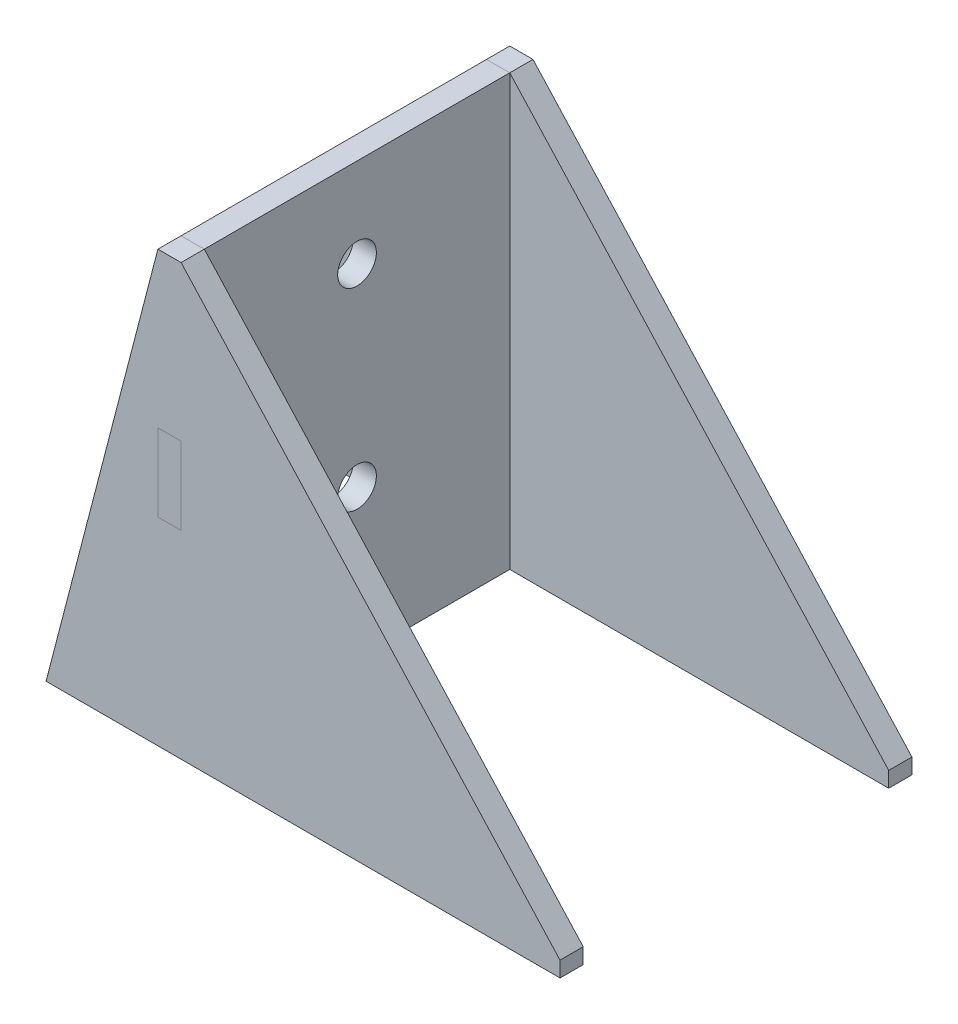
ISO-10303-21;
HEADER;
FILE_DESCRIPTION(('STEP AP214'),'2;1');
FILE_NAME('part.step','',(''),(''),'','','');
FILE_SCHEMA(('AUTOMOTIVE_DESIGN { 1 0 10303 214 1 1 1 1 }'));
ENDSEC;
DATA;
#1=APPLICATION_CONTEXT('core data for automotive mechanical design processes');
#2=APPLICATION_PROTOCOL_DEFINITION('international standard','automotive_design',2000,#1);
#3=PRODUCT_CONTEXT('',#1,'mechanical');
#4=PRODUCT('Part','Part','',(#3));
#5=PRODUCT_RELATED_PRODUCT_CATEGORY('part','',(#4));
#6=PRODUCT_DEFINITION_FORMATION('','',#4);
#7=PRODUCT_DEFINITION_CONTEXT('part definition',#1,'design');
#8=PRODUCT_DEFINITION('design','',#6,#7);
#9=PRODUCT_DEFINITION_SHAPE('','',#8);
#10=(LENGTH_UNIT() NAMED_UNIT(*) SI_UNIT(.MILLI.,.METRE.));
#11=(NAMED_UNIT(*) PLANE_ANGLE_UNIT() SI_UNIT($,.RADIAN.));
#12=(NAMED_UNIT(*) SI_UNIT($,.STERADIAN.) SOLID_ANGLE_UNIT());
#13=UNCERTAINTY_MEASURE_WITH_UNIT(LENGTH_MEASURE(1.E-05),#10,'distance_accuracy_value','');
#14=(GEOMETRIC_REPRESENTATION_CONTEXT(3) GLOBAL_UNCERTAINTY_ASSIGNED_CONTEXT((#13)) GLOBAL_UNIT_ASSIGNED_CONTEXT((#10,
#11,#12)) REPRESENTATION_CONTEXT('',''));
#15=CARTESIAN_POINT('',(0.,0.,0.));
#16=DIRECTION('',(0.,0.,1.));
#17=DIRECTION('',(1.,0.,0.));
#18=AXIS2_PLACEMENT_3D('',#15,#16,#17);
#19=CARTESIAN_POINT('',(84.8675238321578,-376.797488512272,417.047181635811));
#20=DIRECTION('',(0.,0.,1.));
#21=DIRECTION('',(1.,0.,0.));
#22=AXIS2_PLACEMENT_3D('',#19,#20,#21);
#23=PLANE('',#22);
#24=DIRECTION('',(-0.674589209040015,0.738193334463788,0.));
#25=VECTOR('',#24,1.);
#26=CARTESIAN_POINT('',(518.378801320474,3.26976920944033,417.047181635811));
#27=LINE('',#26,#25);
#28=CARTESIAN_POINT('',(518.378801320474,3.26976920944033,417.047181635811));
#29=VERTEX_POINT('',#28);
#30=CARTESIAN_POINT('',(420.378801320474,110.50976920944,417.047181635811));
#31=VERTEX_POINT('',#30);
#32=EDGE_CURVE('E152',#29,#31,#27,.T.);
#33=ORIENTED_EDGE('',*,*,#32,.T.);
#34=DIRECTION('',(-1.,0.,0.));
#35=VECTOR('',#34,1.);
#36=CARTESIAN_POINT('',(420.378801320474,110.50976920944,417.047181635811));
#37=LINE('',#36,#35);
#38=CARTESIAN_POINT('',(414.378801320474,110.50976920944,417.047181635811));
#39=VERTEX_POINT('',#38);
#40=EDGE_CURVE('E155',#31,#39,#37,.T.);
#41=ORIENTED_EDGE('',*,*,#40,.T.);
#42=DIRECTION('',(-0.251589690402251,-0.967833987666945,0.));
#43=VECTOR('',#42,1.);
#44=CARTESIAN_POINT('',(414.378801320474,110.50976920944,417.047181635811));
#45=LINE('',#44,#43);
#46=CARTESIAN_POINT('',(385.461820188399,-0.730230790559672,417.047181635811));
#47=VERTEX_POINT('',#46);
#48=EDGE_CURVE('E158',#39,#47,#45,.T.);
#49=ORIENTED_EDGE('',*,*,#48,.T.);
#50=DIRECTION('',(1.,0.,0.));
#51=VECTOR('',#50,1.);
#52=CARTESIAN_POINT('',(518.378801320474,-0.730230790559616,417.047181635811));
#53=LINE('',#52,#51);
#54=CARTESIAN_POINT('',(518.378801320474,-0.730230790559616,417.047181635811));
#55=VERTEX_POINT('',#54);
#56=EDGE_CURVE('E160',#47,#55,#53,.T.);
#57=ORIENTED_EDGE('',*,*,#56,.T.);
#58=DIRECTION('',(0.,1.,0.));
#59=VECTOR('',#58,1.);
#60=CARTESIAN_POINT('',(518.378801320474,3.26976920944033,417.047181635811));
#61=LINE('',#60,#59);
#62=EDGE_CURVE('E162',#55,#29,#61,.T.);
#63=ORIENTED_EDGE('',*,*,#62,.T.);
#64=EDGE_LOOP('',(#33,#41,#49,#57,#63));
#65=FACE_BOUND('',#64,.T.);
#66=DIRECTION('',(1.,0.,0.));
#67=VECTOR('',#66,1.);
#68=CARTESIAN_POINT('',(414.378801320474,50.5097692094403,417.047181635811));
#69=LINE('',#68,#67);
#70=CARTESIAN_POINT('',(414.378801320474,50.5097692094403,417.047181635811));
#71=VERTEX_POINT('',#70);
#72=CARTESIAN_POINT('',(420.378801320474,50.5097692094403,417.047181635811));
#73=VERTEX_POINT('',#72);
#74=EDGE_CURVE('E124',#71,#73,#69,.T.);
#75=ORIENTED_EDGE('',*,*,#74,.F.);
#76=DIRECTION('',(0.,-1.,0.));
#77=VECTOR('',#76,1.);
#78=CARTESIAN_POINT('',(414.378801320474,70.5097692094403,417.047181635811));
#79=LINE('',#78,#77);
#80=CARTESIAN_POINT('',(414.378801320474,70.5097692094403,417.047181635811));
#81=VERTEX_POINT('',#80);
#82=EDGE_CURVE('E116',#81,#71,#79,.T.);
#83=ORIENTED_EDGE('',*,*,#82,.F.);
#84=DIRECTION('',(-1.,0.,0.));
#85=VECTOR('',#84,1.);
#86=CARTESIAN_POINT('',(420.378801320474,70.5097692094403,417.047181635811));
#87=LINE('',#86,#85);
#88=CARTESIAN_POINT('',(420.378801320474,70.5097692094403,417.047181635811));
#89=VERTEX_POINT('',#88);
#90=EDGE_CURVE('E138',#89,#81,#87,.T.);
#91=ORIENTED_EDGE('',*,*,#90,.F.);
#92=DIRECTION('',(0.,1.,0.));
#93=VECTOR('',#92,1.);
#94=CARTESIAN_POINT('',(420.378801320474,50.5097692094403,417.047181635811));
#95=LINE('',#94,#93);
#96=EDGE_CURVE('E136',#73,#89,#95,.T.);
#97=ORIENTED_EDGE('',*,*,#96,.F.);
#98=EDGE_LOOP('',(#75,#83,#91,#97));
#99=FACE_BOUND('',#98,.T.);
#100=ADVANCED_FACE('F45',(#65,#99),#23,.T.);
#101=CARTESIAN_POINT('',(84.8675238321578,-376.797488512272,411.047181635811));
#102=DIRECTION('',(0.,0.,1.));
#103=DIRECTION('',(1.,0.,0.));
#104=AXIS2_PLACEMENT_3D('',#101,#102,#103);
#105=PLANE('',#104);
#106=DIRECTION('',(-0.674589209040015,0.738193334463788,0.));
#107=VECTOR('',#106,1.);
#108=CARTESIAN_POINT('',(518.378801320474,3.26976920944033,411.047181635811));
#109=LINE('',#108,#107);
#110=CARTESIAN_POINT('',(518.378801320474,3.26976920944033,411.047181635811));
#111=VERTEX_POINT('',#110);
#112=CARTESIAN_POINT('',(420.378801320474,110.50976920944,411.047181635811));
#113=VERTEX_POINT('',#112);
#114=EDGE_CURVE('E132',#111,#113,#109,.T.);
#115=ORIENTED_EDGE('',*,*,#114,.F.);
#116=DIRECTION('',(0.,1.,0.));
#117=VECTOR('',#116,1.);
#118=CARTESIAN_POINT('',(518.378801320474,3.26976920944033,411.047181635811));
#119=LINE('',#118,#117);
#120=CARTESIAN_POINT('',(518.378801320474,-0.730230790559616,411.047181635811));
#121=VERTEX_POINT('',#120);
#122=EDGE_CURVE('E156',#121,#111,#119,.T.);
#123=ORIENTED_EDGE('',*,*,#122,.F.);
#124=DIRECTION('',(1.,0.,0.));
#125=VECTOR('',#124,1.);
#126=CARTESIAN_POINT('',(518.378801320474,-0.730230790559616,411.047181635811));
#127=LINE('',#126,#125);
#128=CARTESIAN_POINT('',(385.461820188399,-0.730230790559672,411.047181635811));
#129=VERTEX_POINT('',#128);
#130=EDGE_CURVE('E171',#129,#121,#127,.T.);
#131=ORIENTED_EDGE('',*,*,#130,.F.);
#132=DIRECTION('',(-0.251589690402251,-0.967833987666945,0.));
#133=VECTOR('',#132,1.);
#134=CARTESIAN_POINT('',(414.378801320474,110.50976920944,411.047181635811));
#135=LINE('',#134,#133);
#136=CARTESIAN_POINT('',(414.378801320474,110.50976920944,411.047181635811));
#137=VERTEX_POINT('',#136);
#138=EDGE_CURVE('E169',#137,#129,#135,.T.);
#139=ORIENTED_EDGE('',*,*,#138,.F.);
#140=DIRECTION('',(-1.,0.,0.));
#141=VECTOR('',#140,1.);
#142=CARTESIAN_POINT('',(420.378801320474,110.50976920944,411.047181635811));
#143=LINE('',#142,#141);
#144=EDGE_CURVE('E167',#113,#137,#143,.T.);
#145=ORIENTED_EDGE('',*,*,#144,.F.);
#146=EDGE_LOOP('',(#115,#123,#131,#139,#145));
#147=FACE_BOUND('',#146,.T.);
#148=DIRECTION('',(0.,-1.,0.));
#149=VECTOR('',#148,1.);
#150=CARTESIAN_POINT('',(414.378801320474,70.5097692094403,411.047181635811));
#151=LINE('',#150,#149);
#152=CARTESIAN_POINT('',(414.378801320474,70.5097692094403,411.047181635811));
#153=VERTEX_POINT('',#152);
#154=CARTESIAN_POINT('',(414.378801320474,50.5097692094403,411.047181635811));
#155=VERTEX_POINT('',#154);
#156=EDGE_CURVE('E68',#153,#155,#151,.T.);
#157=ORIENTED_EDGE('',*,*,#156,.T.);
#158=DIRECTION('',(1.,0.,0.));
#159=VECTOR('',#158,1.);
#160=CARTESIAN_POINT('',(414.378801320474,50.5097692094403,411.047181635811));
#161=LINE('',#160,#159);
#162=CARTESIAN_POINT('',(420.378801320474,50.5097692094403,411.047181635811));
#163=VERTEX_POINT('',#162);
#164=EDGE_CURVE('E131',#155,#163,#161,.T.);
#165=ORIENTED_EDGE('',*,*,#164,.T.);
#166=DIRECTION('',(0.,1.,0.));
#167=VECTOR('',#166,1.);
#168=CARTESIAN_POINT('',(420.378801320474,50.5097692094403,411.047181635811));
#169=LINE('',#168,#167);
#170=CARTESIAN_POINT('',(420.378801320474,70.5097692094403,411.047181635811));
#171=VERTEX_POINT('',#170);
#172=EDGE_CURVE('E144',#163,#171,#169,.T.);
#173=ORIENTED_EDGE('',*,*,#172,.T.);
#174=DIRECTION('',(-1.,0.,0.));
#175=VECTOR('',#174,1.);
#176=CARTESIAN_POINT('',(420.378801320474,70.5097692094403,411.047181635811));
#177=LINE('',#176,#175);
#178=EDGE_CURVE('E125',#171,#153,#177,.T.);
#179=ORIENTED_EDGE('',*,*,#178,.T.);
#180=EDGE_LOOP('',(#157,#165,#173,#179));
#181=FACE_BOUND('',#180,.T.);
#182=ADVANCED_FACE('F192',(#147,#181),#105,.F.);
#183=CARTESIAN_POINT('',(518.378801320474,3.26976920944033,417.047181635811));
#184=DIRECTION('',(-0.738193334463788,-0.674589209040015,0.));
#185=DIRECTION('',(0.674589209040015,-0.738193334463788,0.));
#186=AXIS2_PLACEMENT_3D('',#183,#184,#185);
#187=PLANE('',#186);
#188=ORIENTED_EDGE('',*,*,#114,.T.);
#189=DIRECTION('',(0.,0.,-1.));
#190=VECTOR('',#189,1.);
#191=CARTESIAN_POINT('',(420.378801320474,110.50976920944,417.047181635811));
#192=LINE('',#191,#190);
#193=EDGE_CURVE('E12',#31,#113,#192,.T.);
#194=ORIENTED_EDGE('',*,*,#193,.F.);
#195=ORIENTED_EDGE('',*,*,#32,.F.);
#196=DIRECTION('',(0.,0.,-1.));
#197=VECTOR('',#196,1.);
#198=CARTESIAN_POINT('',(518.378801320474,3.26976920944033,417.047181635811));
#199=LINE('',#198,#197);
#200=EDGE_CURVE('E164',#29,#111,#199,.T.);
#201=ORIENTED_EDGE('',*,*,#200,.T.);
#202=EDGE_LOOP('',(#188,#194,#195,#201));
#203=FACE_BOUND('',#202,.T.);
#204=ADVANCED_FACE('F47',(#203),#187,.F.);
#205=CARTESIAN_POINT('',(420.378801320474,110.50976920944,417.047181635811));
#206=DIRECTION('',(0.,-1.,0.));
#207=DIRECTION('',(0.,0.,-1.));
#208=AXIS2_PLACEMENT_3D('',#205,#206,#207);
#209=PLANE('',#208);
#210=ORIENTED_EDGE('',*,*,#144,.T.);
#211=DIRECTION('',(0.,0.,-1.));
#212=VECTOR('',#211,1.);
#213=CARTESIAN_POINT('',(414.378801320474,110.50976920944,417.047181635811));
#214=LINE('',#213,#212);
#215=EDGE_CURVE('E53',#39,#137,#214,.T.);
#216=ORIENTED_EDGE('',*,*,#215,.F.);
#217=ORIENTED_EDGE('',*,*,#40,.F.);
#218=ORIENTED_EDGE('',*,*,#193,.T.);
#219=EDGE_LOOP('',(#210,#216,#217,#218));
#220=FACE_BOUND('',#219,.T.);
#221=ADVANCED_FACE('F206',(#220),#209,.F.);
#222=CARTESIAN_POINT('',(414.378801320474,110.50976920944,417.047181635811));
#223=DIRECTION('',(0.967833987666945,-0.25158969040225,0.));
#224=DIRECTION('',(0.251589690402251,0.967833987666945,0.));
#225=AXIS2_PLACEMENT_3D('',#222,#223,#224);
#226=PLANE('',#225);
#227=ORIENTED_EDGE('',*,*,#138,.T.);
#228=DIRECTION('',(0.,0.,-1.));
#229=VECTOR('',#228,1.);
#230=CARTESIAN_POINT('',(385.461820188399,-0.730230790559672,417.047181635811));
#231=LINE('',#230,#229);
#232=EDGE_CURVE('E179',#47,#129,#231,.T.);
#233=ORIENTED_EDGE('',*,*,#232,.F.);
#234=ORIENTED_EDGE('',*,*,#48,.F.);
#235=ORIENTED_EDGE('',*,*,#215,.T.);
#236=EDGE_LOOP('',(#227,#233,#234,#235));
#237=FACE_BOUND('',#236,.T.);
#238=ADVANCED_FACE('F186',(#237),#226,.F.);
#239=CARTESIAN_POINT('',(518.378801320474,-0.730230790559616,417.047181635811));
#240=DIRECTION('',(0.,1.,0.));
#241=DIRECTION('',(-1.,0.,0.));
#242=AXIS2_PLACEMENT_3D('',#239,#240,#241);
#243=PLANE('',#242);
#244=ORIENTED_EDGE('',*,*,#130,.T.);
#245=DIRECTION('',(0.,0.,-1.));
#246=VECTOR('',#245,1.);
#247=CARTESIAN_POINT('',(518.378801320474,-0.730230790559616,417.047181635811));
#248=LINE('',#247,#246);
#249=EDGE_CURVE('E176',#55,#121,#248,.T.);
#250=ORIENTED_EDGE('',*,*,#249,.F.);
#251=ORIENTED_EDGE('',*,*,#56,.F.);
#252=ORIENTED_EDGE('',*,*,#232,.T.);
#253=EDGE_LOOP('',(#244,#250,#251,#252));
#254=FACE_BOUND('',#253,.T.);
#255=ADVANCED_FACE('F197',(#254),#243,.F.);
#256=CARTESIAN_POINT('',(518.378801320474,3.26976920944033,417.047181635811));
#257=DIRECTION('',(-1.,0.,0.));
#258=DIRECTION('',(0.,0.,1.));
#259=AXIS2_PLACEMENT_3D('',#256,#257,#258);
#260=PLANE('',#259);
#261=ORIENTED_EDGE('',*,*,#122,.T.);
#262=ORIENTED_EDGE('',*,*,#200,.F.);
#263=ORIENTED_EDGE('',*,*,#62,.F.);
#264=ORIENTED_EDGE('',*,*,#249,.T.);
#265=EDGE_LOOP('',(#261,#262,#263,#264));
#266=FACE_BOUND('',#265,.T.);
#267=ADVANCED_FACE('F201',(#266),#260,.F.);
#268=CARTESIAN_POINT('',(414.378801320474,70.5097692094403,417.047181635811));
#269=DIRECTION('',(1.,0.,0.));
#270=DIRECTION('',(0.,0.,-1.));
#271=AXIS2_PLACEMENT_3D('',#268,#269,#270);
#272=PLANE('',#271);
#273=ORIENTED_EDGE('',*,*,#156,.F.);
#274=DIRECTION('',(0.,0.,-1.));
#275=VECTOR('',#274,1.);
#276=CARTESIAN_POINT('',(414.378801320474,70.5097692094403,417.047181635811));
#277=LINE('',#276,#275);
#278=EDGE_CURVE('E120',#81,#153,#277,.T.);
#279=ORIENTED_EDGE('',*,*,#278,.F.);
#280=ORIENTED_EDGE('',*,*,#82,.T.);
#281=DIRECTION('',(0.,0.,-1.));
#282=VECTOR('',#281,1.);
#283=CARTESIAN_POINT('',(414.378801320474,50.5097692094403,417.047181635811));
#284=LINE('',#283,#282);
#285=EDGE_CURVE('E119',#71,#155,#284,.T.);
#286=ORIENTED_EDGE('',*,*,#285,.T.);
#287=EDGE_LOOP('',(#273,#279,#280,#286));
#288=FACE_BOUND('',#287,.T.);
#289=ADVANCED_FACE('F118',(#288),#272,.T.);
#290=CARTESIAN_POINT('',(414.378801320474,50.5097692094403,417.047181635811));
#291=DIRECTION('',(0.,1.,0.));
#292=DIRECTION('',(0.,0.,1.));
#293=AXIS2_PLACEMENT_3D('',#290,#291,#292);
#294=PLANE('',#293);
#295=ORIENTED_EDGE('',*,*,#164,.F.);
#296=ORIENTED_EDGE('',*,*,#285,.F.);
#297=ORIENTED_EDGE('',*,*,#74,.T.);
#298=DIRECTION('',(0.,0.,-1.));
#299=VECTOR('',#298,1.);
#300=CARTESIAN_POINT('',(420.378801320474,50.5097692094403,417.047181635811));
#301=LINE('',#300,#299);
#302=EDGE_CURVE('E133',#73,#163,#301,.T.);
#303=ORIENTED_EDGE('',*,*,#302,.T.);
#304=EDGE_LOOP('',(#295,#296,#297,#303));
#305=FACE_BOUND('',#304,.T.);
#306=ADVANCED_FACE('F128',(#305),#294,.T.);
#307=CARTESIAN_POINT('',(420.378801320474,50.5097692094403,417.047181635811));
#308=DIRECTION('',(-1.,0.,0.));
#309=DIRECTION('',(0.,0.,1.));
#310=AXIS2_PLACEMENT_3D('',#307,#308,#309);
#311=PLANE('',#310);
#312=ORIENTED_EDGE('',*,*,#172,.F.);
#313=ORIENTED_EDGE('',*,*,#302,.F.);
#314=ORIENTED_EDGE('',*,*,#96,.T.);
#315=DIRECTION('',(0.,0.,-1.));
#316=VECTOR('',#315,1.);
#317=CARTESIAN_POINT('',(420.378801320474,70.5097692094403,417.047181635811));
#318=LINE('',#317,#316);
#319=EDGE_CURVE('E60',#89,#171,#318,.T.);
#320=ORIENTED_EDGE('',*,*,#319,.T.);
#321=EDGE_LOOP('',(#312,#313,#314,#320));
#322=FACE_BOUND('',#321,.T.);
#323=ADVANCED_FACE('F249',(#322),#311,.T.);
#324=CARTESIAN_POINT('',(420.378801320474,70.5097692094403,417.047181635811));
#325=DIRECTION('',(0.,-1.,0.));
#326=DIRECTION('',(0.,0.,-1.));
#327=AXIS2_PLACEMENT_3D('',#324,#325,#326);
#328=PLANE('',#327);
#329=ORIENTED_EDGE('',*,*,#178,.F.);
#330=ORIENTED_EDGE('',*,*,#319,.F.);
#331=ORIENTED_EDGE('',*,*,#90,.T.);
#332=ORIENTED_EDGE('',*,*,#278,.T.);
#333=EDGE_LOOP('',(#329,#330,#331,#332));
#334=FACE_BOUND('',#333,.T.);
#335=ADVANCED_FACE('F255',(#334),#328,.T.);
#336=CLOSED_SHELL('',(#100,#182,#204,#221,#238,#255,#267,#289,#306,#323,#335));
#337=MANIFOLD_SOLID_BREP('B2',#336);
#338=CARTESIAN_POINT('',(420.378801320474,0.,0.));
#339=DIRECTION('',(-1.,0.,0.));
#340=DIRECTION('',(0.,0.,1.));
#341=AXIS2_PLACEMENT_3D('',#338,#339,#340);
#342=PLANE('',#341);
#343=DIRECTION('',(0.,1.,0.));
#344=VECTOR('',#343,1.);
#345=CARTESIAN_POINT('',(420.378801320474,110.50976920944,332.047181635811));
#346=LINE('',#345,#344);
#347=CARTESIAN_POINT('',(420.378801320474,80.5097692094402,332.047181635811));
#348=VERTEX_POINT('',#347);
#349=CARTESIAN_POINT('',(420.378801320474,110.50976920944,332.047181635811));
#350=VERTEX_POINT('',#349);
#351=EDGE_CURVE('E453',#348,#350,#346,.T.);
#352=ORIENTED_EDGE('',*,*,#351,.T.);
#353=DIRECTION('',(0.,0.,1.));
#354=VECTOR('',#353,1.);
#355=CARTESIAN_POINT('',(420.378801320474,110.50976920944,332.047181635811));
#356=LINE('',#355,#354);
#357=CARTESIAN_POINT('',(420.378801320474,110.50976920944,411.047181635811));
#358=VERTEX_POINT('',#357);
#359=EDGE_CURVE('E381',#350,#358,#356,.T.);
#360=ORIENTED_EDGE('',*,*,#359,.T.);
#361=DIRECTION('',(0.,-1.,0.));
#362=VECTOR('',#361,1.);
#363=CARTESIAN_POINT('',(420.378801320474,110.50976920944,411.047181635811));
#364=LINE('',#363,#362);
#365=CARTESIAN_POINT('',(420.378801320474,70.5097692094403,411.047181635811));
#366=VERTEX_POINT('',#365);
#367=EDGE_CURVE('E480',#358,#366,#364,.T.);
#368=ORIENTED_EDGE('',*,*,#367,.T.);
#369=DIRECTION('',(0.,0.,1.));
#370=VECTOR('',#369,1.);
#371=CARTESIAN_POINT('',(420.378801320474,70.5097692094403,417.047181635811));
#372=LINE('',#371,#370);
#373=CARTESIAN_POINT('',(420.378801320474,70.5097692094403,417.047181635811));
#374=VERTEX_POINT('',#373);
#375=EDGE_CURVE('E499',#366,#374,#372,.T.);
#376=ORIENTED_EDGE('',*,*,#375,.T.);
#377=DIRECTION('',(0.,-1.,0.));
#378=VECTOR('',#377,1.);
#379=CARTESIAN_POINT('',(420.378801320474,50.5099140255015,417.047181635811));
#380=LINE('',#379,#378);
#381=CARTESIAN_POINT('',(420.378801320474,50.5099140255015,417.047181635811));
#382=VERTEX_POINT('',#381);
#383=EDGE_CURVE('E496',#374,#382,#380,.T.);
#384=ORIENTED_EDGE('',*,*,#383,.T.);
#385=DIRECTION('',(0.,-4.82720203536056E-05,-0.999999998834906));
#386=VECTOR('',#385,1.);
#387=CARTESIAN_POINT('',(420.378801320474,50.5099140255015,417.047181635811));
#388=LINE('',#387,#386);
#389=CARTESIAN_POINT('',(420.378801320474,50.5096243933791,411.047181635811));
#390=VERTEX_POINT('',#389);
#391=EDGE_CURVE('E498',#382,#390,#388,.T.);
#392=ORIENTED_EDGE('',*,*,#391,.T.);
#393=DIRECTION('',(0.,-1.,0.));
#394=VECTOR('',#393,1.);
#395=CARTESIAN_POINT('',(420.378801320474,50.5096243933791,411.047181635811));
#396=LINE('',#395,#394);
#397=CARTESIAN_POINT('',(420.378801320474,-0.730230790559658,411.047181635811));
#398=VERTEX_POINT('',#397);
#399=EDGE_CURVE('E501',#390,#398,#396,.T.);
#400=ORIENTED_EDGE('',*,*,#399,.T.);
#401=DIRECTION('',(0.,0.,-1.));
#402=VECTOR('',#401,1.);
#403=CARTESIAN_POINT('',(420.378801320474,-0.730230790559658,411.047181635811));
#404=LINE('',#403,#402);
#405=CARTESIAN_POINT('',(420.378801320474,-0.730230790559658,332.047181635811));
#406=VERTEX_POINT('',#405);
#407=EDGE_CURVE('E507',#398,#406,#404,.T.);
#408=ORIENTED_EDGE('',*,*,#407,.T.);
#409=DIRECTION('',(0.,1.,0.));
#410=VECTOR('',#409,1.);
#411=CARTESIAN_POINT('',(420.378801320474,55.5097692094402,332.047181635811));
#412=LINE('',#411,#410);
#413=CARTESIAN_POINT('',(420.378801320474,55.5097692094402,332.047181635811));
#414=VERTEX_POINT('',#413);
#415=EDGE_CURVE('E412',#406,#414,#412,.T.);
#416=ORIENTED_EDGE('',*,*,#415,.T.);
#417=DIRECTION('',(0.,0.,-1.));
#418=VECTOR('',#417,1.);
#419=CARTESIAN_POINT('',(420.378801320474,55.5097692094402,326.047181635811));
#420=LINE('',#419,#418);
#421=CARTESIAN_POINT('',(420.378801320474,55.5097692094402,326.047181635811));
#422=VERTEX_POINT('',#421);
#423=EDGE_CURVE('E406',#414,#422,#420,.T.);
#424=ORIENTED_EDGE('',*,*,#423,.T.);
#425=DIRECTION('',(0.,1.,0.));
#426=VECTOR('',#425,1.);
#427=CARTESIAN_POINT('',(420.378801320474,80.5097692094402,326.047181635811));
#428=LINE('',#427,#426);
#429=CARTESIAN_POINT('',(420.378801320474,80.5097692094402,326.047181635811));
#430=VERTEX_POINT('',#429);
#431=EDGE_CURVE('E410',#422,#430,#428,.T.);
#432=ORIENTED_EDGE('',*,*,#431,.T.);
#433=DIRECTION('',(0.,0.,1.));
#434=VECTOR('',#433,1.);
#435=CARTESIAN_POINT('',(420.378801320474,80.5097692094402,326.047181635811));
#436=LINE('',#435,#434);
#437=EDGE_CURVE('E326',#430,#348,#436,.T.);
#438=ORIENTED_EDGE('',*,*,#437,.T.);
#439=EDGE_LOOP('',(#352,#360,#368,#376,#384,#392,#400,#408,#416,#424,#432,#438));
#440=FACE_BOUND('',#439,.T.);
#441=CARTESIAN_POINT('',(420.378801320474,87.5097692094403,371.547181635811));
#442=DIRECTION('',(1.,0.,0.));
#443=DIRECTION('',(0.,0.,-1.));
#444=AXIS2_PLACEMENT_3D('',#441,#442,#443);
#445=CIRCLE('',#444,4.99999999999999);
#446=CARTESIAN_POINT('',(420.378801320474,87.5097692094403,366.547181635811));
#447=VERTEX_POINT('',#446);
#448=EDGE_CURVE('E434',#447,#447,#445,.T.);
#449=ORIENTED_EDGE('',*,*,#448,.F.);
#450=EDGE_LOOP('',(#449));
#451=FACE_BOUND('',#450,.T.);
#452=CARTESIAN_POINT('',(420.378801320474,37.5097692094403,371.547181635811));
#453=DIRECTION('',(1.,0.,0.));
#454=DIRECTION('',(0.,0.,-1.));
#455=AXIS2_PLACEMENT_3D('',#452,#453,#454);
#456=CIRCLE('',#455,4.99999999999999);
#457=CARTESIAN_POINT('',(420.378801320474,37.5097692094403,366.547181635811));
#458=VERTEX_POINT('',#457);
#459=EDGE_CURVE('E548',#458,#458,#456,.T.);
#460=ORIENTED_EDGE('',*,*,#459,.F.);
#461=EDGE_LOOP('',(#460));
#462=FACE_BOUND('',#461,.T.);
#463=ADVANCED_FACE('F309',(#440,#451,#462),#342,.F.);
#464=CARTESIAN_POINT('',(414.378801320474,0.,0.));
#465=DIRECTION('',(-1.,0.,0.));
#466=DIRECTION('',(0.,0.,1.));
#467=AXIS2_PLACEMENT_3D('',#464,#465,#466);
#468=PLANE('',#467);
#469=CARTESIAN_POINT('',(414.378801320474,87.5097692094403,371.547181635811));
#470=DIRECTION('',(1.,0.,0.));
#471=DIRECTION('',(0.,0.,-1.));
#472=AXIS2_PLACEMENT_3D('',#469,#470,#471);
#473=CIRCLE('',#472,4.99999999999999);
#474=CARTESIAN_POINT('',(414.378801320474,87.5097692094403,366.547181635811));
#475=VERTEX_POINT('',#474);
#476=EDGE_CURVE('E553',#475,#475,#473,.T.);
#477=ORIENTED_EDGE('',*,*,#476,.T.);
#478=EDGE_LOOP('',(#477));
#479=FACE_BOUND('',#478,.T.);
#480=DIRECTION('',(0.,1.,0.));
#481=VECTOR('',#480,1.);
#482=CARTESIAN_POINT('',(414.378801320474,110.50976920944,332.047181635811));
#483=LINE('',#482,#481);
#484=CARTESIAN_POINT('',(414.378801320474,80.5097692094402,332.047181635811));
#485=VERTEX_POINT('',#484);
#486=CARTESIAN_POINT('',(414.378801320474,110.50976920944,332.047181635811));
#487=VERTEX_POINT('',#486);
#488=EDGE_CURVE('E430',#485,#487,#483,.T.);
#489=ORIENTED_EDGE('',*,*,#488,.F.);
#490=DIRECTION('',(0.,0.,1.));
#491=VECTOR('',#490,1.);
#492=CARTESIAN_POINT('',(414.378801320474,80.5097692094402,326.047181635811));
#493=LINE('',#492,#491);
#494=CARTESIAN_POINT('',(414.378801320474,80.5097692094402,326.047181635811));
#495=VERTEX_POINT('',#494);
#496=EDGE_CURVE('E373',#495,#485,#493,.T.);
#497=ORIENTED_EDGE('',*,*,#496,.F.);
#498=DIRECTION('',(0.,1.,0.));
#499=VECTOR('',#498,1.);
#500=CARTESIAN_POINT('',(414.378801320474,80.5097692094402,326.047181635811));
#501=LINE('',#500,#499);
#502=CARTESIAN_POINT('',(414.378801320474,55.5097692094402,326.047181635811));
#503=VERTEX_POINT('',#502);
#504=EDGE_CURVE('E367',#503,#495,#501,.T.);
#505=ORIENTED_EDGE('',*,*,#504,.F.);
#506=DIRECTION('',(0.,0.,-1.));
#507=VECTOR('',#506,1.);
#508=CARTESIAN_POINT('',(414.378801320474,55.5097692094402,326.047181635811));
#509=LINE('',#508,#507);
#510=CARTESIAN_POINT('',(414.378801320474,55.5097692094402,332.047181635811));
#511=VERTEX_POINT('',#510);
#512=EDGE_CURVE('E420',#511,#503,#509,.T.);
#513=ORIENTED_EDGE('',*,*,#512,.F.);
#514=DIRECTION('',(0.,1.,0.));
#515=VECTOR('',#514,1.);
#516=CARTESIAN_POINT('',(414.378801320474,55.5097692094402,332.047181635811));
#517=LINE('',#516,#515);
#518=CARTESIAN_POINT('',(414.378801320474,-0.730230790559658,332.047181635811));
#519=VERTEX_POINT('',#518);
#520=EDGE_CURVE('E448',#519,#511,#517,.T.);
#521=ORIENTED_EDGE('',*,*,#520,.F.);
#522=DIRECTION('',(0.,0.,-1.));
#523=VECTOR('',#522,1.);
#524=CARTESIAN_POINT('',(414.378801320474,-0.730230790559658,411.047181635811));
#525=LINE('',#524,#523);
#526=CARTESIAN_POINT('',(414.378801320474,-0.730230790559658,411.047181635811));
#527=VERTEX_POINT('',#526);
#528=EDGE_CURVE('E446',#527,#519,#525,.T.);
#529=ORIENTED_EDGE('',*,*,#528,.F.);
#530=DIRECTION('',(0.,-1.,0.));
#531=VECTOR('',#530,1.);
#532=CARTESIAN_POINT('',(414.378801320474,50.5096243933791,411.047181635811));
#533=LINE('',#532,#531);
#534=CARTESIAN_POINT('',(414.378801320474,50.5096243933791,411.047181635811));
#535=VERTEX_POINT('',#534);
#536=EDGE_CURVE('E444',#535,#527,#533,.T.);
#537=ORIENTED_EDGE('',*,*,#536,.F.);
#538=DIRECTION('',(0.,-4.82720203536056E-05,-0.999999998834906));
#539=VECTOR('',#538,1.);
#540=CARTESIAN_POINT('',(414.378801320474,50.5099140255015,417.047181635811));
#541=LINE('',#540,#539);
#542=CARTESIAN_POINT('',(414.378801320474,50.5099140255015,417.047181635811));
#543=VERTEX_POINT('',#542);
#544=EDGE_CURVE('E442',#543,#535,#541,.T.);
#545=ORIENTED_EDGE('',*,*,#544,.F.);
#546=DIRECTION('',(0.,-1.,0.));
#547=VECTOR('',#546,1.);
#548=CARTESIAN_POINT('',(414.378801320474,50.5099140255015,417.047181635811));
#549=LINE('',#548,#547);
#550=CARTESIAN_POINT('',(414.378801320474,70.5097692094403,417.047181635811));
#551=VERTEX_POINT('',#550);
#552=EDGE_CURVE('E440',#551,#543,#549,.T.);
#553=ORIENTED_EDGE('',*,*,#552,.F.);
#554=DIRECTION('',(0.,0.,1.));
#555=VECTOR('',#554,1.);
#556=CARTESIAN_POINT('',(414.378801320474,70.5097692094403,417.047181635811));
#557=LINE('',#556,#555);
#558=CARTESIAN_POINT('',(414.378801320474,70.5097692094403,411.047181635811));
#559=VERTEX_POINT('',#558);
#560=EDGE_CURVE('E438',#559,#551,#557,.T.);
#561=ORIENTED_EDGE('',*,*,#560,.F.);
#562=DIRECTION('',(0.,-1.,0.));
#563=VECTOR('',#562,1.);
#564=CARTESIAN_POINT('',(414.378801320474,110.50976920944,411.047181635811));
#565=LINE('',#564,#563);
#566=CARTESIAN_POINT('',(414.378801320474,110.50976920944,411.047181635811));
#567=VERTEX_POINT('',#566);
#568=EDGE_CURVE('E436',#567,#559,#565,.T.);
#569=ORIENTED_EDGE('',*,*,#568,.F.);
#570=DIRECTION('',(0.,0.,1.));
#571=VECTOR('',#570,1.);
#572=CARTESIAN_POINT('',(414.378801320474,110.50976920944,332.047181635811));
#573=LINE('',#572,#571);
#574=EDGE_CURVE('E433',#487,#567,#573,.T.);
#575=ORIENTED_EDGE('',*,*,#574,.F.);
#576=EDGE_LOOP('',(#489,#497,#505,#513,#521,#529,#537,#545,#553,#561,#569,#575));
#577=FACE_BOUND('',#576,.T.);
#578=CARTESIAN_POINT('',(414.378801320474,37.5097692094403,371.547181635811));
#579=DIRECTION('',(1.,0.,0.));
#580=DIRECTION('',(0.,0.,-1.));
#581=AXIS2_PLACEMENT_3D('',#578,#579,#580);
#582=CIRCLE('',#581,4.99999999999999);
#583=CARTESIAN_POINT('',(414.378801320474,37.5097692094403,366.547181635811));
#584=VERTEX_POINT('',#583);
#585=EDGE_CURVE('E551',#584,#584,#582,.T.);
#586=ORIENTED_EDGE('',*,*,#585,.T.);
#587=EDGE_LOOP('',(#586));
#588=FACE_BOUND('',#587,.T.);
#589=ADVANCED_FACE('F484',(#479,#577,#588),#468,.T.);
#590=CARTESIAN_POINT('',(420.378801320474,110.50976920944,332.047181635811));
#591=DIRECTION('',(0.,0.,1.));
#592=DIRECTION('',(1.,0.,0.));
#593=AXIS2_PLACEMENT_3D('',#590,#591,#592);
#594=PLANE('',#593);
#595=ORIENTED_EDGE('',*,*,#488,.T.);
#596=DIRECTION('',(-1.,0.,0.));
#597=VECTOR('',#596,1.);
#598=CARTESIAN_POINT('',(420.378801320474,110.50976920944,332.047181635811));
#599=LINE('',#598,#597);
#600=EDGE_CURVE('E43',#350,#487,#599,.T.);
#601=ORIENTED_EDGE('',*,*,#600,.F.);
#602=ORIENTED_EDGE('',*,*,#351,.F.);
#603=DIRECTION('',(-1.,0.,0.));
#604=VECTOR('',#603,1.);
#605=CARTESIAN_POINT('',(420.378801320474,80.5097692094402,332.047181635811));
#606=LINE('',#605,#604);
#607=EDGE_CURVE('E426',#348,#485,#606,.T.);
#608=ORIENTED_EDGE('',*,*,#607,.T.);
#609=EDGE_LOOP('',(#595,#601,#602,#608));
#610=FACE_BOUND('',#609,.T.);
#611=ADVANCED_FACE('F311',(#610),#594,.F.);
#612=CARTESIAN_POINT('',(420.378801320474,110.50976920944,332.047181635811));
#613=DIRECTION('',(0.,-1.,0.));
#614=DIRECTION('',(0.,0.,-1.));
#615=AXIS2_PLACEMENT_3D('',#612,#613,#614);
#616=PLANE('',#615);
#617=ORIENTED_EDGE('',*,*,#574,.T.);
#618=DIRECTION('',(-1.,0.,0.));
#619=VECTOR('',#618,1.);
#620=CARTESIAN_POINT('',(420.378801320474,110.50976920944,411.047181635811));
#621=LINE('',#620,#619);
#622=EDGE_CURVE('E318',#358,#567,#621,.T.);
#623=ORIENTED_EDGE('',*,*,#622,.F.);
#624=ORIENTED_EDGE('',*,*,#359,.F.);
#625=ORIENTED_EDGE('',*,*,#600,.T.);
#626=EDGE_LOOP('',(#617,#623,#624,#625));
#627=FACE_BOUND('',#626,.T.);
#628=ADVANCED_FACE('F648',(#627),#616,.F.);
#629=CARTESIAN_POINT('',(420.378801320474,110.50976920944,411.047181635811));
#630=DIRECTION('',(0.,0.,-1.));
#631=DIRECTION('',(-1.,0.,0.));
#632=AXIS2_PLACEMENT_3D('',#629,#630,#631);
#633=PLANE('',#632);
#634=ORIENTED_EDGE('',*,*,#568,.T.);
#635=DIRECTION('',(-1.,0.,0.));
#636=VECTOR('',#635,1.);
#637=CARTESIAN_POINT('',(420.378801320474,70.5097692094403,411.047181635811));
#638=LINE('',#637,#636);
#639=EDGE_CURVE('E472',#366,#559,#638,.T.);
#640=ORIENTED_EDGE('',*,*,#639,.F.);
#641=ORIENTED_EDGE('',*,*,#367,.F.);
#642=ORIENTED_EDGE('',*,*,#622,.T.);
#643=EDGE_LOOP('',(#634,#640,#641,#642));
#644=FACE_BOUND('',#643,.T.);
#645=ADVANCED_FACE('F478',(#644),#633,.F.);
#646=CARTESIAN_POINT('',(420.378801320474,70.5097692094403,417.047181635811));
#647=DIRECTION('',(0.,-1.,0.));
#648=DIRECTION('',(0.,0.,-1.));
#649=AXIS2_PLACEMENT_3D('',#646,#647,#648);
#650=PLANE('',#649);
#651=ORIENTED_EDGE('',*,*,#560,.T.);
#652=DIRECTION('',(-1.,0.,0.));
#653=VECTOR('',#652,1.);
#654=CARTESIAN_POINT('',(420.378801320474,70.5097692094403,417.047181635811));
#655=LINE('',#654,#653);
#656=EDGE_CURVE('E469',#374,#551,#655,.T.);
#657=ORIENTED_EDGE('',*,*,#656,.F.);
#658=ORIENTED_EDGE('',*,*,#375,.F.);
#659=ORIENTED_EDGE('',*,*,#639,.T.);
#660=EDGE_LOOP('',(#651,#657,#658,#659));
#661=FACE_BOUND('',#660,.T.);
#662=ADVANCED_FACE('F490',(#661),#650,.F.);
#663=CARTESIAN_POINT('',(420.378801320474,50.5099140255015,417.047181635811));
#664=DIRECTION('',(0.,0.,-1.));
#665=DIRECTION('',(-1.,0.,0.));
#666=AXIS2_PLACEMENT_3D('',#663,#664,#665);
#667=PLANE('',#666);
#668=ORIENTED_EDGE('',*,*,#552,.T.);
#669=DIRECTION('',(-1.,0.,0.));
#670=VECTOR('',#669,1.);
#671=CARTESIAN_POINT('',(420.378801320474,50.5099140255015,417.047181635811));
#672=LINE('',#671,#670);
#673=EDGE_CURVE('E466',#382,#543,#672,.T.);
#674=ORIENTED_EDGE('',*,*,#673,.F.);
#675=ORIENTED_EDGE('',*,*,#383,.F.);
#676=ORIENTED_EDGE('',*,*,#656,.T.);
#677=EDGE_LOOP('',(#668,#674,#675,#676));
#678=FACE_BOUND('',#677,.T.);
#679=ADVANCED_FACE('F494',(#678),#667,.F.);
#680=CARTESIAN_POINT('',(420.378801320474,50.5099140255015,417.047181635811));
#681=DIRECTION('',(0.,0.999999998834906,-4.82720203536056E-05));
#682=DIRECTION('',(0.,4.82720203536056E-05,0.999999998834906));
#683=AXIS2_PLACEMENT_3D('',#680,#681,#682);
#684=PLANE('',#683);
#685=ORIENTED_EDGE('',*,*,#544,.T.);
#686=DIRECTION('',(-1.,0.,0.));
#687=VECTOR('',#686,1.);
#688=CARTESIAN_POINT('',(420.378801320474,50.5096243933791,411.047181635811));
#689=LINE('',#688,#687);
#690=EDGE_CURVE('E463',#390,#535,#689,.T.);
#691=ORIENTED_EDGE('',*,*,#690,.F.);
#692=ORIENTED_EDGE('',*,*,#391,.F.);
#693=ORIENTED_EDGE('',*,*,#673,.T.);
#694=EDGE_LOOP('',(#685,#691,#692,#693));
#695=FACE_BOUND('',#694,.T.);
#696=ADVANCED_FACE('F613',(#695),#684,.F.);
#697=CARTESIAN_POINT('',(420.378801320474,50.5096243933791,411.047181635811));
#698=DIRECTION('',(0.,0.,-1.));
#699=DIRECTION('',(-1.,0.,0.));
#700=AXIS2_PLACEMENT_3D('',#697,#698,#699);
#701=PLANE('',#700);
#702=ORIENTED_EDGE('',*,*,#536,.T.);
#703=DIRECTION('',(-1.,0.,0.));
#704=VECTOR('',#703,1.);
#705=CARTESIAN_POINT('',(420.378801320474,-0.730230790559658,411.047181635811));
#706=LINE('',#705,#704);
#707=EDGE_CURVE('E460',#398,#527,#706,.T.);
#708=ORIENTED_EDGE('',*,*,#707,.F.);
#709=ORIENTED_EDGE('',*,*,#399,.F.);
#710=ORIENTED_EDGE('',*,*,#690,.T.);
#711=EDGE_LOOP('',(#702,#708,#709,#710));
#712=FACE_BOUND('',#711,.T.);
#713=ADVANCED_FACE('F604',(#712),#701,.F.);
#714=CARTESIAN_POINT('',(420.378801320474,-0.730230790559658,411.047181635811));
#715=DIRECTION('',(0.,1.,0.));
#716=DIRECTION('',(0.,0.,1.));
#717=AXIS2_PLACEMENT_3D('',#714,#715,#716);
#718=PLANE('',#717);
#719=ORIENTED_EDGE('',*,*,#528,.T.);
#720=DIRECTION('',(-1.,0.,0.));
#721=VECTOR('',#720,1.);
#722=CARTESIAN_POINT('',(420.378801320474,-0.730230790559658,332.047181635811));
#723=LINE('',#722,#721);
#724=EDGE_CURVE('E457',#406,#519,#723,.T.);
#725=ORIENTED_EDGE('',*,*,#724,.F.);
#726=ORIENTED_EDGE('',*,*,#407,.F.);
#727=ORIENTED_EDGE('',*,*,#707,.T.);
#728=EDGE_LOOP('',(#719,#725,#726,#727));
#729=FACE_BOUND('',#728,.T.);
#730=ADVANCED_FACE('F513',(#729),#718,.F.);
#731=CARTESIAN_POINT('',(420.378801320474,55.5097692094402,332.047181635811));
#732=DIRECTION('',(0.,0.,1.));
#733=DIRECTION('',(1.,0.,0.));
#734=AXIS2_PLACEMENT_3D('',#731,#732,#733);
#735=PLANE('',#734);
#736=ORIENTED_EDGE('',*,*,#520,.T.);
#737=DIRECTION('',(-1.,0.,0.));
#738=VECTOR('',#737,1.);
#739=CARTESIAN_POINT('',(420.378801320474,55.5097692094402,332.047181635811));
#740=LINE('',#739,#738);
#741=EDGE_CURVE('E421',#414,#511,#740,.T.);
#742=ORIENTED_EDGE('',*,*,#741,.F.);
#743=ORIENTED_EDGE('',*,*,#415,.F.);
#744=ORIENTED_EDGE('',*,*,#724,.T.);
#745=EDGE_LOOP('',(#736,#742,#743,#744));
#746=FACE_BOUND('',#745,.T.);
#747=ADVANCED_FACE('F517',(#746),#735,.F.);
#748=CARTESIAN_POINT('',(420.378801320474,55.5097692094402,326.047181635811));
#749=DIRECTION('',(0.,1.,0.));
#750=DIRECTION('',(0.,0.,1.));
#751=AXIS2_PLACEMENT_3D('',#748,#749,#750);
#752=PLANE('',#751);
#753=ORIENTED_EDGE('',*,*,#512,.T.);
#754=DIRECTION('',(-1.,0.,0.));
#755=VECTOR('',#754,1.);
#756=CARTESIAN_POINT('',(420.378801320474,55.5097692094402,326.047181635811));
#757=LINE('',#756,#755);
#758=EDGE_CURVE('E417',#422,#503,#757,.T.);
#759=ORIENTED_EDGE('',*,*,#758,.F.);
#760=ORIENTED_EDGE('',*,*,#423,.F.);
#761=ORIENTED_EDGE('',*,*,#741,.T.);
#762=EDGE_LOOP('',(#753,#759,#760,#761));
#763=FACE_BOUND('',#762,.T.);
#764=ADVANCED_FACE('F418',(#763),#752,.F.);
#765=CARTESIAN_POINT('',(420.378801320474,80.5097692094402,326.047181635811));
#766=DIRECTION('',(0.,0.,1.));
#767=DIRECTION('',(1.,0.,0.));
#768=AXIS2_PLACEMENT_3D('',#765,#766,#767);
#769=PLANE('',#768);
#770=ORIENTED_EDGE('',*,*,#504,.T.);
#771=DIRECTION('',(-1.,0.,0.));
#772=VECTOR('',#771,1.);
#773=CARTESIAN_POINT('',(420.378801320474,80.5097692094402,326.047181635811));
#774=LINE('',#773,#772);
#775=EDGE_CURVE('E422',#430,#495,#774,.T.);
#776=ORIENTED_EDGE('',*,*,#775,.F.);
#777=ORIENTED_EDGE('',*,*,#431,.F.);
#778=ORIENTED_EDGE('',*,*,#758,.T.);
#779=EDGE_LOOP('',(#770,#776,#777,#778));
#780=FACE_BOUND('',#779,.T.);
#781=ADVANCED_FACE('F424',(#780),#769,.F.);
#782=CARTESIAN_POINT('',(420.378801320474,80.5097692094402,326.047181635811));
#783=DIRECTION('',(0.,-1.,0.));
#784=DIRECTION('',(0.,0.,-1.));
#785=AXIS2_PLACEMENT_3D('',#782,#783,#784);
#786=PLANE('',#785);
#787=ORIENTED_EDGE('',*,*,#496,.T.);
#788=ORIENTED_EDGE('',*,*,#607,.F.);
#789=ORIENTED_EDGE('',*,*,#437,.F.);
#790=ORIENTED_EDGE('',*,*,#775,.T.);
#791=EDGE_LOOP('',(#787,#788,#789,#790));
#792=FACE_BOUND('',#791,.T.);
#793=ADVANCED_FACE('F521',(#792),#786,.F.);
#794=CARTESIAN_POINT('',(420.378801320474,87.5097692094403,371.547181635811));
#795=DIRECTION('',(-1.,0.,0.));
#796=DIRECTION('',(0.,0.,1.));
#797=AXIS2_PLACEMENT_3D('',#794,#795,#796);
#798=CYLINDRICAL_SURFACE('',#797,4.99999999999999);
#799=ORIENTED_EDGE('',*,*,#448,.T.);
#800=EDGE_LOOP('',(#799));
#801=FACE_BOUND('',#800,.T.);
#802=ORIENTED_EDGE('',*,*,#476,.F.);
#803=EDGE_LOOP('',(#802));
#804=FACE_BOUND('',#803,.T.);
#805=ADVANCED_FACE('F523',(#801,#804),#798,.F.);
#806=CARTESIAN_POINT('',(420.378801320474,37.5097692094403,371.547181635811));
#807=DIRECTION('',(-1.,0.,0.));
#808=DIRECTION('',(0.,0.,1.));
#809=AXIS2_PLACEMENT_3D('',#806,#807,#808);
#810=CYLINDRICAL_SURFACE('',#809,4.99999999999999);
#811=ORIENTED_EDGE('',*,*,#459,.T.);
#812=EDGE_LOOP('',(#811));
#813=FACE_BOUND('',#812,.T.);
#814=ORIENTED_EDGE('',*,*,#585,.F.);
#815=EDGE_LOOP('',(#814));
#816=FACE_BOUND('',#815,.T.);
#817=ADVANCED_FACE('F529',(#813,#816),#810,.F.);
#818=CLOSED_SHELL('',(#463,#589,#611,#628,#645,#662,#679,#696,#713,#730,#747,#764,#781,#793,
#805,#817));
#819=MANIFOLD_SOLID_BREP('B6',#818);
#820=CARTESIAN_POINT('',(-134.806391245104,0.,332.047181635811));
#821=DIRECTION('',(0.,0.,-1.));
#822=DIRECTION('',(-1.,0.,0.));
#823=AXIS2_PLACEMENT_3D('',#820,#821,#822);
#824=PLANE('',#823);
#825=DIRECTION('',(0.,1.,0.));
#826=VECTOR('',#825,1.);
#827=CARTESIAN_POINT('',(518.378801320474,3.26628762541812,332.047181635811));
#828=LINE('',#827,#826);
#829=CARTESIAN_POINT('',(518.378801320474,-0.73371237458188,332.047181635811));
#830=VERTEX_POINT('',#829);
#831=CARTESIAN_POINT('',(518.378801320474,3.26628762541812,332.047181635811));
#832=VERTEX_POINT('',#831);
#833=EDGE_CURVE('E789',#830,#832,#828,.T.);
#834=ORIENTED_EDGE('',*,*,#833,.T.);
#835=DIRECTION('',(-0.674589209040015,0.738193334463789,0.));
#836=VECTOR('',#835,1.);
#837=CARTESIAN_POINT('',(420.378801320474,110.506287625418,332.047181635811));
#838=LINE('',#837,#836);
#839=CARTESIAN_POINT('',(420.378801320474,110.506287625418,332.047181635811));
#840=VERTEX_POINT('',#839);
#841=EDGE_CURVE('E792',#832,#840,#838,.T.);
#842=ORIENTED_EDGE('',*,*,#841,.T.);
#843=DIRECTION('',(-1.,0.,0.));
#844=VECTOR('',#843,1.);
#845=CARTESIAN_POINT('',(414.378801320474,110.506287625418,332.047181635811));
#846=LINE('',#845,#844);
#847=CARTESIAN_POINT('',(414.378801320474,110.506287625418,332.047181635811));
#848=VERTEX_POINT('',#847);
#849=EDGE_CURVE('E795',#840,#848,#846,.T.);
#850=ORIENTED_EDGE('',*,*,#849,.T.);
#851=DIRECTION('',(-0.544430336907689,-0.838806061169434,0.));
#852=VECTOR('',#851,1.);
#853=CARTESIAN_POINT('',(342.178046603493,-0.733712374581905,332.047181635811));
#854=LINE('',#853,#852);
#855=CARTESIAN_POINT('',(342.178046603493,-0.733712374581905,332.047181635811));
#856=VERTEX_POINT('',#855);
#857=EDGE_CURVE('E797',#848,#856,#854,.T.);
#858=ORIENTED_EDGE('',*,*,#857,.T.);
#859=DIRECTION('',(1.,0.,0.));
#860=VECTOR('',#859,1.);
#861=CARTESIAN_POINT('',(518.378801320474,-0.73371237458188,332.047181635811));
#862=LINE('',#861,#860);
#863=EDGE_CURVE('E799',#856,#830,#862,.T.);
#864=ORIENTED_EDGE('',*,*,#863,.T.);
#865=EDGE_LOOP('',(#834,#842,#850,#858,#864));
#866=FACE_BOUND('',#865,.T.);
#867=DIRECTION('',(0.,1.,0.));
#868=VECTOR('',#867,1.);
#869=CARTESIAN_POINT('',(420.378801320474,80.5062876254181,332.047181635811));
#870=LINE('',#869,#868);
#871=CARTESIAN_POINT('',(420.378801320474,55.5062876254181,332.047181635811));
#872=VERTEX_POINT('',#871);
#873=CARTESIAN_POINT('',(420.378801320474,80.5062876254181,332.047181635811));
#874=VERTEX_POINT('',#873);
#875=EDGE_CURVE('E753',#872,#874,#870,.T.);
#876=ORIENTED_EDGE('',*,*,#875,.F.);
#877=DIRECTION('',(1.,0.,0.));
#878=VECTOR('',#877,1.);
#879=CARTESIAN_POINT('',(420.378801320474,55.5062876254181,332.047181635811));
#880=LINE('',#879,#878);
#881=CARTESIAN_POINT('',(414.378801320474,55.5062876254181,332.047181635811));
#882=VERTEX_POINT('',#881);
#883=EDGE_CURVE('E775',#882,#872,#880,.T.);
#884=ORIENTED_EDGE('',*,*,#883,.F.);
#885=DIRECTION('',(0.,-1.,0.));
#886=VECTOR('',#885,1.);
#887=CARTESIAN_POINT('',(414.378801320474,55.5062876254181,332.047181635811));
#888=LINE('',#887,#886);
#889=CARTESIAN_POINT('',(414.378801320474,80.5062876254181,332.047181635811));
#890=VERTEX_POINT('',#889);
#891=EDGE_CURVE('E773',#890,#882,#888,.T.);
#892=ORIENTED_EDGE('',*,*,#891,.F.);
#893=DIRECTION('',(-1.,0.,0.));
#894=VECTOR('',#893,1.);
#895=CARTESIAN_POINT('',(414.378801320474,80.5062876254181,332.047181635811));
#896=LINE('',#895,#894);
#897=EDGE_CURVE('E761',#874,#890,#896,.T.);
#898=ORIENTED_EDGE('',*,*,#897,.F.);
#899=EDGE_LOOP('',(#876,#884,#892,#898));
#900=FACE_BOUND('',#899,.T.);
#901=ADVANCED_FACE('F682',(#866,#900),#824,.F.);
#902=CARTESIAN_POINT('',(-134.806391245104,0.,326.047181635811));
#903=DIRECTION('',(0.,0.,-1.));
#904=DIRECTION('',(-1.,0.,0.));
#905=AXIS2_PLACEMENT_3D('',#902,#903,#904);
#906=PLANE('',#905);
#907=DIRECTION('',(0.,1.,0.));
#908=VECTOR('',#907,1.);
#909=CARTESIAN_POINT('',(518.378801320474,3.26628762541812,326.047181635811));
#910=LINE('',#909,#908);
#911=CARTESIAN_POINT('',(518.378801320474,-0.73371237458188,326.047181635811));
#912=VERTEX_POINT('',#911);
#913=CARTESIAN_POINT('',(518.378801320474,3.26628762541812,326.047181635811));
#914=VERTEX_POINT('',#913);
#915=EDGE_CURVE('E769',#912,#914,#910,.T.);
#916=ORIENTED_EDGE('',*,*,#915,.F.);
#917=DIRECTION('',(1.,0.,0.));
#918=VECTOR('',#917,1.);
#919=CARTESIAN_POINT('',(518.378801320474,-0.73371237458188,326.047181635811));
#920=LINE('',#919,#918);
#921=CARTESIAN_POINT('',(342.178046603493,-0.733712374581905,326.047181635811));
#922=VERTEX_POINT('',#921);
#923=EDGE_CURVE('E793',#922,#912,#920,.T.);
#924=ORIENTED_EDGE('',*,*,#923,.F.);
#925=DIRECTION('',(-0.544430336907689,-0.838806061169434,0.));
#926=VECTOR('',#925,1.);
#927=CARTESIAN_POINT('',(342.178046603493,-0.733712374581905,326.047181635811));
#928=LINE('',#927,#926);
#929=CARTESIAN_POINT('',(414.378801320474,110.506287625418,326.047181635811));
#930=VERTEX_POINT('',#929);
#931=EDGE_CURVE('E808',#930,#922,#928,.T.);
#932=ORIENTED_EDGE('',*,*,#931,.F.);
#933=DIRECTION('',(-1.,0.,0.));
#934=VECTOR('',#933,1.);
#935=CARTESIAN_POINT('',(414.378801320474,110.506287625418,326.047181635811));
#936=LINE('',#935,#934);
#937=CARTESIAN_POINT('',(420.378801320474,110.506287625418,326.047181635811));
#938=VERTEX_POINT('',#937);
#939=EDGE_CURVE('E806',#938,#930,#936,.T.);
#940=ORIENTED_EDGE('',*,*,#939,.F.);
#941=DIRECTION('',(-0.674589209040015,0.738193334463789,0.));
#942=VECTOR('',#941,1.);
#943=CARTESIAN_POINT('',(420.378801320474,110.506287625418,326.047181635811));
#944=LINE('',#943,#942);
#945=EDGE_CURVE('E804',#914,#938,#944,.T.);
#946=ORIENTED_EDGE('',*,*,#945,.F.);
#947=EDGE_LOOP('',(#916,#924,#932,#940,#946));
#948=FACE_BOUND('',#947,.T.);
#949=DIRECTION('',(1.,0.,0.));
#950=VECTOR('',#949,1.);
#951=CARTESIAN_POINT('',(420.378801320474,55.5062876254181,326.047181635811));
#952=LINE('',#951,#950);
#953=CARTESIAN_POINT('',(414.378801320474,55.5062876254181,326.047181635811));
#954=VERTEX_POINT('',#953);
#955=CARTESIAN_POINT('',(420.378801320474,55.5062876254181,326.047181635811));
#956=VERTEX_POINT('',#955);
#957=EDGE_CURVE('E762',#954,#956,#952,.T.);
#958=ORIENTED_EDGE('',*,*,#957,.T.);
#959=DIRECTION('',(0.,1.,0.));
#960=VECTOR('',#959,1.);
#961=CARTESIAN_POINT('',(420.378801320474,80.5062876254181,326.047181635811));
#962=LINE('',#961,#960);
#963=CARTESIAN_POINT('',(420.378801320474,80.5062876254181,326.047181635811));
#964=VERTEX_POINT('',#963);
#965=EDGE_CURVE('E705',#956,#964,#962,.T.);
#966=ORIENTED_EDGE('',*,*,#965,.T.);
#967=DIRECTION('',(-1.,0.,0.));
#968=VECTOR('',#967,1.);
#969=CARTESIAN_POINT('',(414.378801320474,80.5062876254181,326.047181635811));
#970=LINE('',#969,#968);
#971=CARTESIAN_POINT('',(414.378801320474,80.5062876254181,326.047181635811));
#972=VERTEX_POINT('',#971);
#973=EDGE_CURVE('E768',#964,#972,#970,.T.);
#974=ORIENTED_EDGE('',*,*,#973,.T.);
#975=DIRECTION('',(0.,-1.,0.));
#976=VECTOR('',#975,1.);
#977=CARTESIAN_POINT('',(414.378801320474,55.5062876254181,326.047181635811));
#978=LINE('',#977,#976);
#979=EDGE_CURVE('E781',#972,#954,#978,.T.);
#980=ORIENTED_EDGE('',*,*,#979,.T.);
#981=EDGE_LOOP('',(#958,#966,#974,#980));
#982=FACE_BOUND('',#981,.T.);
#983=ADVANCED_FACE('F829',(#948,#982),#906,.T.);
#984=CARTESIAN_POINT('',(518.378801320474,3.26628762541812,332.047181635811));
#985=DIRECTION('',(-1.,0.,0.));
#986=DIRECTION('',(0.,0.,1.));
#987=AXIS2_PLACEMENT_3D('',#984,#985,#986);
#988=PLANE('',#987);
#989=ORIENTED_EDGE('',*,*,#915,.T.);
#990=DIRECTION('',(0.,0.,-1.));
#991=VECTOR('',#990,1.);
#992=CARTESIAN_POINT('',(518.378801320474,3.26628762541812,332.047181635811));
#993=LINE('',#992,#991);
#994=EDGE_CURVE('E307',#832,#914,#993,.T.);
#995=ORIENTED_EDGE('',*,*,#994,.F.);
#996=ORIENTED_EDGE('',*,*,#833,.F.);
#997=DIRECTION('',(0.,0.,-1.));
#998=VECTOR('',#997,1.);
#999=CARTESIAN_POINT('',(518.378801320474,-0.73371237458188,332.047181635811));
#1000=LINE('',#999,#998);
#1001=EDGE_CURVE('E801',#830,#912,#1000,.T.);
#1002=ORIENTED_EDGE('',*,*,#1001,.T.);
#1003=EDGE_LOOP('',(#989,#995,#996,#1002));
#1004=FACE_BOUND('',#1003,.T.);
#1005=ADVANCED_FACE('F684',(#1004),#988,.F.);
#1006=CARTESIAN_POINT('',(420.378801320474,110.506287625418,332.047181635811));
#1007=DIRECTION('',(-0.738193334463789,-0.674589209040015,0.));
#1008=DIRECTION('',(0.674589209040015,-0.738193334463789,0.));
#1009=AXIS2_PLACEMENT_3D('',#1006,#1007,#1008);
#1010=PLANE('',#1009);
#1011=ORIENTED_EDGE('',*,*,#945,.T.);
#1012=DIRECTION('',(0.,0.,-1.));
#1013=VECTOR('',#1012,1.);
#1014=CARTESIAN_POINT('',(420.378801320474,110.506287625418,332.047181635811));
#1015=LINE('',#1014,#1013);
#1016=EDGE_CURVE('E690',#840,#938,#1015,.T.);
#1017=ORIENTED_EDGE('',*,*,#1016,.F.);
#1018=ORIENTED_EDGE('',*,*,#841,.F.);
#1019=ORIENTED_EDGE('',*,*,#994,.T.);
#1020=EDGE_LOOP('',(#1011,#1017,#1018,#1019));
#1021=FACE_BOUND('',#1020,.T.);
#1022=ADVANCED_FACE('F843',(#1021),#1010,.F.);
#1023=CARTESIAN_POINT('',(414.378801320474,110.506287625418,332.047181635811));
#1024=DIRECTION('',(0.,-1.,0.));
#1025=DIRECTION('',(0.,0.,-1.));
#1026=AXIS2_PLACEMENT_3D('',#1023,#1024,#1025);
#1027=PLANE('',#1026);
#1028=ORIENTED_EDGE('',*,*,#939,.T.);
#1029=DIRECTION('',(0.,0.,-1.));
#1030=VECTOR('',#1029,1.);
#1031=CARTESIAN_POINT('',(414.378801320474,110.506287625418,332.047181635811));
#1032=LINE('',#1031,#1030);
#1033=EDGE_CURVE('E816',#848,#930,#1032,.T.);
#1034=ORIENTED_EDGE('',*,*,#1033,.F.);
#1035=ORIENTED_EDGE('',*,*,#849,.F.);
#1036=ORIENTED_EDGE('',*,*,#1016,.T.);
#1037=EDGE_LOOP('',(#1028,#1034,#1035,#1036));
#1038=FACE_BOUND('',#1037,.T.);
#1039=ADVANCED_FACE('F823',(#1038),#1027,.F.);
#1040=CARTESIAN_POINT('',(342.178046603493,-0.733712374581905,332.047181635811));
#1041=DIRECTION('',(0.838806061169434,-0.544430336907689,0.));
#1042=DIRECTION('',(0.544430336907689,0.838806061169434,0.));
#1043=AXIS2_PLACEMENT_3D('',#1040,#1041,#1042);
#1044=PLANE('',#1043);
#1045=ORIENTED_EDGE('',*,*,#931,.T.);
#1046=DIRECTION('',(0.,0.,-1.));
#1047=VECTOR('',#1046,1.);
#1048=CARTESIAN_POINT('',(342.178046603493,-0.733712374581905,332.047181635811));
#1049=LINE('',#1048,#1047);
#1050=EDGE_CURVE('E813',#856,#922,#1049,.T.);
#1051=ORIENTED_EDGE('',*,*,#1050,.F.);
#1052=ORIENTED_EDGE('',*,*,#857,.F.);
#1053=ORIENTED_EDGE('',*,*,#1033,.T.);
#1054=EDGE_LOOP('',(#1045,#1051,#1052,#1053));
#1055=FACE_BOUND('',#1054,.T.);
#1056=ADVANCED_FACE('F834',(#1055),#1044,.F.);
#1057=CARTESIAN_POINT('',(518.378801320474,-0.73371237458188,332.047181635811));
#1058=DIRECTION('',(0.,1.,0.));
#1059=DIRECTION('',(-1.,0.,0.));
#1060=AXIS2_PLACEMENT_3D('',#1057,#1058,#1059);
#1061=PLANE('',#1060);
#1062=ORIENTED_EDGE('',*,*,#923,.T.);
#1063=ORIENTED_EDGE('',*,*,#1001,.F.);
#1064=ORIENTED_EDGE('',*,*,#863,.F.);
#1065=ORIENTED_EDGE('',*,*,#1050,.T.);
#1066=EDGE_LOOP('',(#1062,#1063,#1064,#1065));
#1067=FACE_BOUND('',#1066,.T.);
#1068=ADVANCED_FACE('F838',(#1067),#1061,.F.);
#1069=CARTESIAN_POINT('',(420.378801320474,80.5062876254181,332.047181635811));
#1070=DIRECTION('',(-1.,0.,0.));
#1071=DIRECTION('',(0.,0.,1.));
#1072=AXIS2_PLACEMENT_3D('',#1069,#1070,#1071);
#1073=PLANE('',#1072);
#1074=ORIENTED_EDGE('',*,*,#965,.F.);
#1075=DIRECTION('',(0.,0.,-1.));
#1076=VECTOR('',#1075,1.);
#1077=CARTESIAN_POINT('',(420.378801320474,55.5062876254181,332.047181635811));
#1078=LINE('',#1077,#1076);
#1079=EDGE_CURVE('E757',#872,#956,#1078,.T.);
#1080=ORIENTED_EDGE('',*,*,#1079,.F.);
#1081=ORIENTED_EDGE('',*,*,#875,.T.);
#1082=DIRECTION('',(0.,0.,-1.));
#1083=VECTOR('',#1082,1.);
#1084=CARTESIAN_POINT('',(420.378801320474,80.5062876254181,332.047181635811));
#1085=LINE('',#1084,#1083);
#1086=EDGE_CURVE('E756',#874,#964,#1085,.T.);
#1087=ORIENTED_EDGE('',*,*,#1086,.T.);
#1088=EDGE_LOOP('',(#1074,#1080,#1081,#1087));
#1089=FACE_BOUND('',#1088,.T.);
#1090=ADVANCED_FACE('F755',(#1089),#1073,.T.);
#1091=CARTESIAN_POINT('',(414.378801320474,80.5062876254181,332.047181635811));
#1092=DIRECTION('',(0.,-1.,0.));
#1093=DIRECTION('',(0.,0.,-1.));
#1094=AXIS2_PLACEMENT_3D('',#1091,#1092,#1093);
#1095=PLANE('',#1094);
#1096=ORIENTED_EDGE('',*,*,#973,.F.);
#1097=ORIENTED_EDGE('',*,*,#1086,.F.);
#1098=ORIENTED_EDGE('',*,*,#897,.T.);
#1099=DIRECTION('',(0.,0.,-1.));
#1100=VECTOR('',#1099,1.);
#1101=CARTESIAN_POINT('',(414.378801320474,80.5062876254181,332.047181635811));
#1102=LINE('',#1101,#1100);
#1103=EDGE_CURVE('E770',#890,#972,#1102,.T.);
#1104=ORIENTED_EDGE('',*,*,#1103,.T.);
#1105=EDGE_LOOP('',(#1096,#1097,#1098,#1104));
#1106=FACE_BOUND('',#1105,.T.);
#1107=ADVANCED_FACE('F765',(#1106),#1095,.T.);
#1108=CARTESIAN_POINT('',(414.378801320474,55.5062876254181,332.047181635811));
#1109=DIRECTION('',(1.,0.,0.));
#1110=DIRECTION('',(0.,1.,0.));
#1111=AXIS2_PLACEMENT_3D('',#1108,#1109,#1110);
#1112=PLANE('',#1111);
#1113=ORIENTED_EDGE('',*,*,#979,.F.);
#1114=ORIENTED_EDGE('',*,*,#1103,.F.);
#1115=ORIENTED_EDGE('',*,*,#891,.T.);
#1116=DIRECTION('',(0.,0.,-1.));
#1117=VECTOR('',#1116,1.);
#1118=CARTESIAN_POINT('',(414.378801320474,55.5062876254181,332.047181635811));
#1119=LINE('',#1118,#1117);
#1120=EDGE_CURVE('E697',#882,#954,#1119,.T.);
#1121=ORIENTED_EDGE('',*,*,#1120,.T.);
#1122=EDGE_LOOP('',(#1113,#1114,#1115,#1121));
#1123=FACE_BOUND('',#1122,.T.);
#1124=ADVANCED_FACE('F886',(#1123),#1112,.T.);
#1125=CARTESIAN_POINT('',(420.378801320474,55.5062876254181,332.047181635811));
#1126=DIRECTION('',(0.,1.,0.));
#1127=DIRECTION('',(0.,0.,1.));
#1128=AXIS2_PLACEMENT_3D('',#1125,#1126,#1127);
#1129=PLANE('',#1128);
#1130=ORIENTED_EDGE('',*,*,#957,.F.);
#1131=ORIENTED_EDGE('',*,*,#1120,.F.);
#1132=ORIENTED_EDGE('',*,*,#883,.T.);
#1133=ORIENTED_EDGE('',*,*,#1079,.T.);
#1134=EDGE_LOOP('',(#1130,#1131,#1132,#1133));
#1135=FACE_BOUND('',#1134,.T.);
#1136=ADVANCED_FACE('F892',(#1135),#1129,.T.);
#1137=CLOSED_SHELL('',(#901,#983,#1005,#1022,#1039,#1056,#1068,#1090,#1107,#1124,#1136));
#1138=MANIFOLD_SOLID_BREP('B37',#1137);
#1139=ADVANCED_BREP_SHAPE_REPRESENTATION('',(#18,#337,#819,#1138),#14);
#1140=SHAPE_DEFINITION_REPRESENTATION(#9,#1139);
ENDSEC;
END-ISO-10303-21;
